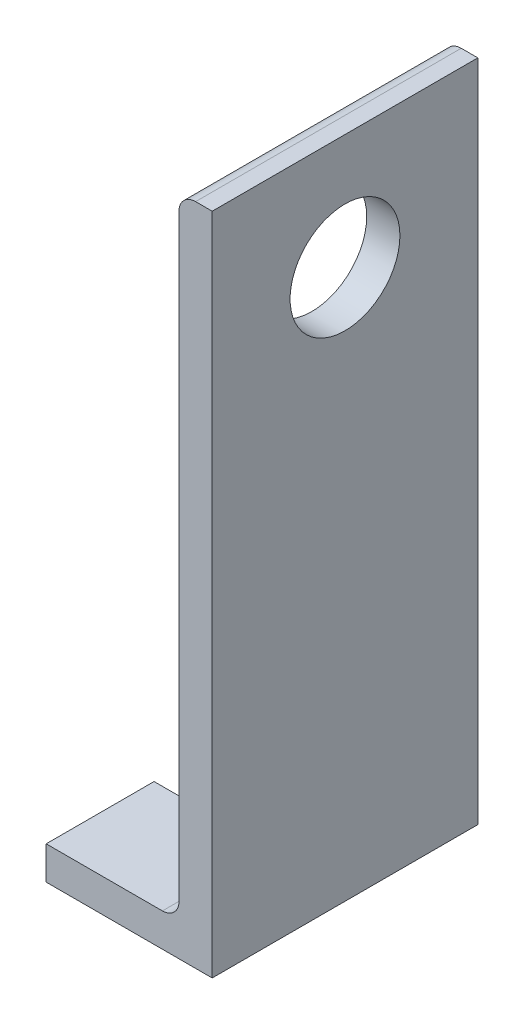
ISO-10303-21;
HEADER;
FILE_DESCRIPTION(('STEP AP214'),'2;1');
FILE_NAME('part.step','',(''),(''),'','','');
FILE_SCHEMA(('AUTOMOTIVE_DESIGN { 1 0 10303 214 1 1 1 1 }'));
ENDSEC;
DATA;
#1=APPLICATION_CONTEXT('core data for automotive mechanical design processes');
#2=APPLICATION_PROTOCOL_DEFINITION('international standard','automotive_design',2000,#1);
#3=PRODUCT_CONTEXT('',#1,'mechanical');
#4=PRODUCT('Part','Part','',(#3));
#5=PRODUCT_RELATED_PRODUCT_CATEGORY('part','',(#4));
#6=PRODUCT_DEFINITION_FORMATION('','',#4);
#7=PRODUCT_DEFINITION_CONTEXT('part definition',#1,'design');
#8=PRODUCT_DEFINITION('design','',#6,#7);
#9=PRODUCT_DEFINITION_SHAPE('','',#8);
#10=(LENGTH_UNIT() NAMED_UNIT(*) SI_UNIT(.MILLI.,.METRE.));
#11=(NAMED_UNIT(*) PLANE_ANGLE_UNIT() SI_UNIT($,.RADIAN.));
#12=(NAMED_UNIT(*) SI_UNIT($,.STERADIAN.) SOLID_ANGLE_UNIT());
#13=UNCERTAINTY_MEASURE_WITH_UNIT(LENGTH_MEASURE(1.E-05),#10,'distance_accuracy_value','');
#14=(GEOMETRIC_REPRESENTATION_CONTEXT(3) GLOBAL_UNCERTAINTY_ASSIGNED_CONTEXT((#13)) GLOBAL_UNIT_ASSIGNED_CONTEXT((#10,
#11,#12)) REPRESENTATION_CONTEXT('',''));
#15=CARTESIAN_POINT('',(0.,0.,0.));
#16=DIRECTION('',(0.,0.,1.));
#17=DIRECTION('',(1.,0.,0.));
#18=AXIS2_PLACEMENT_3D('',#15,#16,#17);
#19=CARTESIAN_POINT('',(-15.875,6.35,25.4));
#20=DIRECTION('',(1.,0.,0.));
#21=DIRECTION('',(0.,0.,-1.));
#22=AXIS2_PLACEMENT_3D('',#19,#20,#21);
#23=PLANE('',#22);
#24=DIRECTION('',(0.,0.,-1.));
#25=VECTOR('',#24,1.);
#26=CARTESIAN_POINT('',(-15.875,0.,25.4));
#27=LINE('',#26,#25);
#28=CARTESIAN_POINT('',(-15.875,0.,-4.765));
#29=VERTEX_POINT('',#28);
#30=CARTESIAN_POINT('',(-15.875,0.,-25.4));
#31=VERTEX_POINT('',#30);
#32=EDGE_CURVE('E237',#29,#31,#27,.T.);
#33=ORIENTED_EDGE('',*,*,#32,.F.);
#34=DIRECTION('',(0.,-1.,0.));
#35=VECTOR('',#34,1.);
#36=CARTESIAN_POINT('',(-15.875,10.,-4.765));
#37=LINE('',#36,#35);
#38=CARTESIAN_POINT('',(-15.875,6.35,-4.765));
#39=VERTEX_POINT('',#38);
#40=EDGE_CURVE('E271',#39,#29,#37,.T.);
#41=ORIENTED_EDGE('',*,*,#40,.F.);
#42=DIRECTION('',(0.,0.,-1.));
#43=VECTOR('',#42,1.);
#44=CARTESIAN_POINT('',(-15.875,6.35,25.4));
#45=LINE('',#44,#43);
#46=CARTESIAN_POINT('',(-15.875,6.35,-25.4));
#47=VERTEX_POINT('',#46);
#48=EDGE_CURVE('E183',#39,#47,#45,.T.);
#49=ORIENTED_EDGE('',*,*,#48,.T.);
#50=DIRECTION('',(0.,-1.,0.));
#51=VECTOR('',#50,1.);
#52=CARTESIAN_POINT('',(-15.875,6.35,-25.4));
#53=LINE('',#52,#51);
#54=EDGE_CURVE('E162',#47,#31,#53,.T.);
#55=ORIENTED_EDGE('',*,*,#54,.T.);
#56=EDGE_LOOP('',(#33,#41,#49,#55));
#57=FACE_BOUND('',#56,.T.);
#58=ADVANCED_FACE('F39',(#57),#23,.F.);
#59=CARTESIAN_POINT('',(-4.826,127.,0.));
#60=DIRECTION('',(0.,-1.,0.));
#61=DIRECTION('',(0.,0.,-1.));
#62=AXIS2_PLACEMENT_3D('',#59,#60,#61);
#63=CYLINDRICAL_SURFACE('',#62,4.765);
#64=DIRECTION('',(0.,-1.,0.));
#65=VECTOR('',#64,1.);
#66=CARTESIAN_POINT('',(-4.826,127.,-4.765));
#67=LINE('',#66,#65);
#68=CARTESIAN_POINT('',(-4.826,0.,-4.765));
#69=VERTEX_POINT('',#68);
#70=CARTESIAN_POINT('',(-4.826,6.34999999999999,-4.765));
#71=VERTEX_POINT('',#70);
#72=EDGE_CURVE('E11',#69,#71,#67,.F.);
#73=ORIENTED_EDGE('',*,*,#72,.F.);
#74=CARTESIAN_POINT('',(-4.826,0.,0.));
#75=DIRECTION('',(0.,-1.,0.));
#76=DIRECTION('',(0.,0.,-1.));
#77=AXIS2_PLACEMENT_3D('',#74,#75,#76);
#78=CIRCLE('',#77,4.765);
#79=CARTESIAN_POINT('',(-4.826,0.,4.765));
#80=VERTEX_POINT('',#79);
#81=EDGE_CURVE('E138',#69,#80,#78,.T.);
#82=ORIENTED_EDGE('',*,*,#81,.T.);
#83=DIRECTION('',(0.,-1.,0.));
#84=VECTOR('',#83,1.);
#85=CARTESIAN_POINT('',(-4.826,127.,4.765));
#86=LINE('',#85,#84);
#87=CARTESIAN_POINT('',(-4.826,6.34999999999999,4.765));
#88=VERTEX_POINT('',#87);
#89=EDGE_CURVE('E48',#80,#88,#86,.F.);
#90=ORIENTED_EDGE('',*,*,#89,.T.);
#91=CARTESIAN_POINT('',(-4.826,6.34999999999999,0.));
#92=DIRECTION('',(0.,-1.,0.));
#93=DIRECTION('',(0.,0.,-1.));
#94=AXIS2_PLACEMENT_3D('',#91,#92,#93);
#95=CIRCLE('',#94,4.765);
#96=EDGE_CURVE('E144',#71,#88,#95,.T.);
#97=ORIENTED_EDGE('',*,*,#96,.F.);
#98=EDGE_LOOP('',(#73,#82,#90,#97));
#99=FACE_BOUND('',#98,.T.);
#100=ADVANCED_FACE('F142',(#99),#63,.F.);
#101=CARTESIAN_POINT('',(-15.875,0.,25.4));
#102=DIRECTION('',(0.,1.,0.));
#103=DIRECTION('',(0.,0.,1.));
#104=AXIS2_PLACEMENT_3D('',#101,#102,#103);
#105=PLANE('',#104);
#106=ORIENTED_EDGE('',*,*,#81,.F.);
#107=DIRECTION('',(1.,0.,0.));
#108=VECTOR('',#107,1.);
#109=CARTESIAN_POINT('',(-4.826,0.,-4.765));
#110=LINE('',#109,#108);
#111=EDGE_CURVE('E62',#29,#69,#110,.T.);
#112=ORIENTED_EDGE('',*,*,#111,.F.);
#113=ORIENTED_EDGE('',*,*,#32,.T.);
#114=DIRECTION('',(1.,0.,0.));
#115=VECTOR('',#114,1.);
#116=CARTESIAN_POINT('',(-15.875,0.,-25.4));
#117=LINE('',#116,#115);
#118=CARTESIAN_POINT('',(15.875,0.,-25.4));
#119=VERTEX_POINT('',#118);
#120=EDGE_CURVE('E149',#31,#119,#117,.T.);
#121=ORIENTED_EDGE('',*,*,#120,.T.);
#122=DIRECTION('',(0.,0.,-1.));
#123=VECTOR('',#122,1.);
#124=CARTESIAN_POINT('',(15.875,0.,25.4));
#125=LINE('',#124,#123);
#126=CARTESIAN_POINT('',(15.875,0.,25.4));
#127=VERTEX_POINT('',#126);
#128=EDGE_CURVE('E233',#127,#119,#125,.T.);
#129=ORIENTED_EDGE('',*,*,#128,.F.);
#130=DIRECTION('',(1.,0.,0.));
#131=VECTOR('',#130,1.);
#132=CARTESIAN_POINT('',(-15.875,0.,25.4));
#133=LINE('',#132,#131);
#134=CARTESIAN_POINT('',(-15.875,0.,25.4));
#135=VERTEX_POINT('',#134);
#136=EDGE_CURVE('E161',#135,#127,#133,.T.);
#137=ORIENTED_EDGE('',*,*,#136,.F.);
#138=CARTESIAN_POINT('',(-15.875,0.,4.765));
#139=VERTEX_POINT('',#138);
#140=EDGE_CURVE('E134',#135,#139,#27,.T.);
#141=ORIENTED_EDGE('',*,*,#140,.T.);
#142=DIRECTION('',(-1.,0.,0.));
#143=VECTOR('',#142,1.);
#144=CARTESIAN_POINT('',(-4.826,0.,4.765));
#145=LINE('',#144,#143);
#146=EDGE_CURVE('E127',#80,#139,#145,.T.);
#147=ORIENTED_EDGE('',*,*,#146,.F.);
#148=EDGE_LOOP('',(#106,#112,#113,#121,#129,#137,#141,#147));
#149=FACE_BOUND('',#148,.T.);
#150=ADVANCED_FACE('F41',(#149),#105,.F.);
#151=CARTESIAN_POINT('',(15.875,0.,25.4));
#152=DIRECTION('',(-1.,0.,0.));
#153=DIRECTION('',(0.,0.,1.));
#154=AXIS2_PLACEMENT_3D('',#151,#152,#153);
#155=PLANE('',#154);
#156=CARTESIAN_POINT('',(15.875,105.,0.));
#157=DIRECTION('',(1.,0.,0.));
#158=DIRECTION('',(0.,0.,-1.));
#159=AXIS2_PLACEMENT_3D('',#156,#157,#158);
#160=CIRCLE('',#159,10.5);
#161=CARTESIAN_POINT('',(15.875,105.,-10.5));
#162=VERTEX_POINT('',#161);
#163=EDGE_CURVE('E152',#162,#162,#160,.T.);
#164=ORIENTED_EDGE('',*,*,#163,.F.);
#165=EDGE_LOOP('',(#164));
#166=FACE_BOUND('',#165,.T.);
#167=DIRECTION('',(0.,1.,0.));
#168=VECTOR('',#167,1.);
#169=CARTESIAN_POINT('',(15.875,0.,-25.4));
#170=LINE('',#169,#168);
#171=CARTESIAN_POINT('',(15.875,127.,-25.4));
#172=VERTEX_POINT('',#171);
#173=EDGE_CURVE('E186',#119,#172,#170,.T.);
#174=ORIENTED_EDGE('',*,*,#173,.T.);
#175=DIRECTION('',(0.,0.,-1.));
#176=VECTOR('',#175,1.);
#177=CARTESIAN_POINT('',(15.875,127.,25.4));
#178=LINE('',#177,#176);
#179=CARTESIAN_POINT('',(15.875,127.,25.4));
#180=VERTEX_POINT('',#179);
#181=EDGE_CURVE('E229',#180,#172,#178,.T.);
#182=ORIENTED_EDGE('',*,*,#181,.F.);
#183=DIRECTION('',(0.,1.,0.));
#184=VECTOR('',#183,1.);
#185=CARTESIAN_POINT('',(15.875,0.,25.4));
#186=LINE('',#185,#184);
#187=EDGE_CURVE('E165',#127,#180,#186,.T.);
#188=ORIENTED_EDGE('',*,*,#187,.F.);
#189=ORIENTED_EDGE('',*,*,#128,.T.);
#190=EDGE_LOOP('',(#174,#182,#188,#189));
#191=FACE_BOUND('',#190,.T.);
#192=ADVANCED_FACE('F254',(#166,#191),#155,.F.);
#193=CARTESIAN_POINT('',(12.7,127.,25.4));
#194=DIRECTION('',(0.,-1.,0.));
#195=DIRECTION('',(0.,0.,-1.));
#196=AXIS2_PLACEMENT_3D('',#193,#194,#195);
#197=PLANE('',#196);
#198=DIRECTION('',(-1.,0.,0.));
#199=VECTOR('',#198,1.);
#200=CARTESIAN_POINT('',(12.7,127.,-25.4));
#201=LINE('',#200,#199);
#202=CARTESIAN_POINT('',(12.7,127.,-25.4));
#203=VERTEX_POINT('',#202);
#204=EDGE_CURVE('E189',#172,#203,#201,.T.);
#205=ORIENTED_EDGE('',*,*,#204,.T.);
#206=DIRECTION('',(0.,0.,-1.));
#207=VECTOR('',#206,1.);
#208=CARTESIAN_POINT('',(12.7,127.,25.4));
#209=LINE('',#208,#207);
#210=CARTESIAN_POINT('',(12.7,127.,25.4));
#211=VERTEX_POINT('',#210);
#212=EDGE_CURVE('E225',#211,#203,#209,.T.);
#213=ORIENTED_EDGE('',*,*,#212,.F.);
#214=DIRECTION('',(-1.,0.,0.));
#215=VECTOR('',#214,1.);
#216=CARTESIAN_POINT('',(12.7,127.,25.4));
#217=LINE('',#216,#215);
#218=EDGE_CURVE('E168',#180,#211,#217,.T.);
#219=ORIENTED_EDGE('',*,*,#218,.F.);
#220=ORIENTED_EDGE('',*,*,#181,.T.);
#221=EDGE_LOOP('',(#205,#213,#219,#220));
#222=FACE_BOUND('',#221,.T.);
#223=ADVANCED_FACE('F258',(#222),#197,.F.);
#224=CARTESIAN_POINT('',(12.7,123.825,25.4));
#225=DIRECTION('',(0.,0.,-1.));
#226=DIRECTION('',(-1.,0.,0.));
#227=AXIS2_PLACEMENT_3D('',#224,#225,#226);
#228=CYLINDRICAL_SURFACE('',#227,3.175);
#229=CARTESIAN_POINT('',(12.7,123.825,-25.4));
#230=DIRECTION('',(0.,0.,1.));
#231=DIRECTION('',(-1.,0.,0.));
#232=AXIS2_PLACEMENT_3D('',#229,#230,#231);
#233=CIRCLE('',#232,3.175);
#234=CARTESIAN_POINT('',(9.525,123.825,-25.4));
#235=VERTEX_POINT('',#234);
#236=EDGE_CURVE('E192',#203,#235,#233,.T.);
#237=ORIENTED_EDGE('',*,*,#236,.T.);
#238=DIRECTION('',(0.,0.,-1.));
#239=VECTOR('',#238,1.);
#240=CARTESIAN_POINT('',(9.525,123.825,25.4));
#241=LINE('',#240,#239);
#242=CARTESIAN_POINT('',(9.525,123.825,25.4));
#243=VERTEX_POINT('',#242);
#244=EDGE_CURVE('E221',#243,#235,#241,.T.);
#245=ORIENTED_EDGE('',*,*,#244,.F.);
#246=CARTESIAN_POINT('',(12.7,123.825,25.4));
#247=DIRECTION('',(0.,0.,1.));
#248=DIRECTION('',(-1.,0.,0.));
#249=AXIS2_PLACEMENT_3D('',#246,#247,#248);
#250=CIRCLE('',#249,3.175);
#251=EDGE_CURVE('E171',#211,#243,#250,.T.);
#252=ORIENTED_EDGE('',*,*,#251,.F.);
#253=ORIENTED_EDGE('',*,*,#212,.T.);
#254=EDGE_LOOP('',(#237,#245,#252,#253));
#255=FACE_BOUND('',#254,.T.);
#256=ADVANCED_FACE('F295',(#255),#228,.T.);
#257=CARTESIAN_POINT('',(9.525,123.825,25.4));
#258=DIRECTION('',(1.,0.,0.));
#259=DIRECTION('',(0.,1.,0.));
#260=AXIS2_PLACEMENT_3D('',#257,#258,#259);
#261=PLANE('',#260);
#262=CARTESIAN_POINT('',(9.52500000000001,105.,0.));
#263=DIRECTION('',(1.,0.,0.));
#264=DIRECTION('',(0.,1.,0.));
#265=AXIS2_PLACEMENT_3D('',#262,#263,#264);
#266=CIRCLE('',#265,10.5);
#267=CARTESIAN_POINT('',(9.525,115.5,0.));
#268=VERTEX_POINT('',#267);
#269=EDGE_CURVE('E145',#268,#268,#266,.T.);
#270=ORIENTED_EDGE('',*,*,#269,.T.);
#271=EDGE_LOOP('',(#270));
#272=FACE_BOUND('',#271,.T.);
#273=DIRECTION('',(0.,-1.,0.));
#274=VECTOR('',#273,1.);
#275=CARTESIAN_POINT('',(9.525,123.825,-25.4));
#276=LINE('',#275,#274);
#277=CARTESIAN_POINT('',(9.52500000000003,9.52500000000001,-25.4));
#278=VERTEX_POINT('',#277);
#279=EDGE_CURVE('E195',#235,#278,#276,.T.);
#280=ORIENTED_EDGE('',*,*,#279,.T.);
#281=DIRECTION('',(0.,0.,-1.));
#282=VECTOR('',#281,1.);
#283=CARTESIAN_POINT('',(9.52500000000003,9.52500000000001,25.4));
#284=LINE('',#283,#282);
#285=CARTESIAN_POINT('',(9.52500000000003,9.52500000000001,25.4));
#286=VERTEX_POINT('',#285);
#287=EDGE_CURVE('E217',#286,#278,#284,.T.);
#288=ORIENTED_EDGE('',*,*,#287,.F.);
#289=DIRECTION('',(0.,-1.,0.));
#290=VECTOR('',#289,1.);
#291=CARTESIAN_POINT('',(9.525,123.825,25.4));
#292=LINE('',#291,#290);
#293=EDGE_CURVE('E174',#243,#286,#292,.T.);
#294=ORIENTED_EDGE('',*,*,#293,.F.);
#295=ORIENTED_EDGE('',*,*,#244,.T.);
#296=EDGE_LOOP('',(#280,#288,#294,#295));
#297=FACE_BOUND('',#296,.T.);
#298=ADVANCED_FACE('F316',(#272,#297),#261,.F.);
#299=CARTESIAN_POINT('',(6.35000000000003,9.52500000000001,25.4));
#300=DIRECTION('',(0.,0.,-1.));
#301=DIRECTION('',(-1.,0.,0.));
#302=AXIS2_PLACEMENT_3D('',#299,#300,#301);
#303=CYLINDRICAL_SURFACE('',#302,3.175);
#304=CARTESIAN_POINT('',(6.35000000000003,9.52500000000001,-25.4));
#305=DIRECTION('',(0.,0.,-1.));
#306=DIRECTION('',(-1.,0.,0.));
#307=AXIS2_PLACEMENT_3D('',#304,#305,#306);
#308=CIRCLE('',#307,3.175);
#309=CARTESIAN_POINT('',(6.35000000000003,6.35,-25.4));
#310=VERTEX_POINT('',#309);
#311=EDGE_CURVE('E198',#278,#310,#308,.T.);
#312=ORIENTED_EDGE('',*,*,#311,.T.);
#313=DIRECTION('',(0.,0.,-1.));
#314=VECTOR('',#313,1.);
#315=CARTESIAN_POINT('',(6.35000000000003,6.35,25.4));
#316=LINE('',#315,#314);
#317=CARTESIAN_POINT('',(6.35000000000003,6.35,25.4));
#318=VERTEX_POINT('',#317);
#319=EDGE_CURVE('E213',#318,#310,#316,.T.);
#320=ORIENTED_EDGE('',*,*,#319,.F.);
#321=CARTESIAN_POINT('',(6.35000000000003,9.52500000000001,25.4));
#322=DIRECTION('',(0.,0.,-1.));
#323=DIRECTION('',(-1.,0.,0.));
#324=AXIS2_PLACEMENT_3D('',#321,#322,#323);
#325=CIRCLE('',#324,3.175);
#326=EDGE_CURVE('E177',#286,#318,#325,.T.);
#327=ORIENTED_EDGE('',*,*,#326,.F.);
#328=ORIENTED_EDGE('',*,*,#287,.T.);
#329=EDGE_LOOP('',(#312,#320,#327,#328));
#330=FACE_BOUND('',#329,.T.);
#331=ADVANCED_FACE('F312',(#330),#303,.F.);
#332=CARTESIAN_POINT('',(-12.7,6.35,25.4));
#333=DIRECTION('',(0.,-1.,0.));
#334=DIRECTION('',(0.,0.,-1.));
#335=AXIS2_PLACEMENT_3D('',#332,#333,#334);
#336=PLANE('',#335);
#337=ORIENTED_EDGE('',*,*,#48,.F.);
#338=DIRECTION('',(1.,0.,0.));
#339=VECTOR('',#338,1.);
#340=CARTESIAN_POINT('',(-12.7,6.35,-4.765));
#341=LINE('',#340,#339);
#342=EDGE_CURVE('E279',#39,#71,#341,.T.);
#343=ORIENTED_EDGE('',*,*,#342,.T.);
#344=ORIENTED_EDGE('',*,*,#96,.T.);
#345=DIRECTION('',(-1.,0.,0.));
#346=VECTOR('',#345,1.);
#347=CARTESIAN_POINT('',(-12.7,6.35,4.765));
#348=LINE('',#347,#346);
#349=CARTESIAN_POINT('',(-15.875,6.35,4.765));
#350=VERTEX_POINT('',#349);
#351=EDGE_CURVE('E55',#88,#350,#348,.T.);
#352=ORIENTED_EDGE('',*,*,#351,.T.);
#353=CARTESIAN_POINT('',(-15.875,6.35,25.4));
#354=VERTEX_POINT('',#353);
#355=EDGE_CURVE('E209',#354,#350,#45,.T.);
#356=ORIENTED_EDGE('',*,*,#355,.F.);
#357=DIRECTION('',(-1.,0.,0.));
#358=VECTOR('',#357,1.);
#359=CARTESIAN_POINT('',(6.35000000000003,6.35,25.4));
#360=LINE('',#359,#358);
#361=EDGE_CURVE('E180',#318,#354,#360,.T.);
#362=ORIENTED_EDGE('',*,*,#361,.F.);
#363=ORIENTED_EDGE('',*,*,#319,.T.);
#364=DIRECTION('',(-1.,0.,0.));
#365=VECTOR('',#364,1.);
#366=CARTESIAN_POINT('',(-12.7,6.35,-25.4));
#367=LINE('',#366,#365);
#368=EDGE_CURVE('E202',#310,#47,#367,.T.);
#369=ORIENTED_EDGE('',*,*,#368,.T.);
#370=EDGE_LOOP('',(#337,#343,#344,#352,#356,#362,#363,#369));
#371=FACE_BOUND('',#370,.T.);
#372=ADVANCED_FACE('F306',(#371),#336,.F.);
#373=ORIENTED_EDGE('',*,*,#355,.T.);
#374=DIRECTION('',(0.,-1.,0.));
#375=VECTOR('',#374,1.);
#376=CARTESIAN_POINT('',(-15.875,10.,4.765));
#377=LINE('',#376,#375);
#378=EDGE_CURVE('E269',#350,#139,#377,.T.);
#379=ORIENTED_EDGE('',*,*,#378,.T.);
#380=ORIENTED_EDGE('',*,*,#140,.F.);
#381=DIRECTION('',(0.,-1.,0.));
#382=VECTOR('',#381,1.);
#383=CARTESIAN_POINT('',(-15.875,3.175,25.4));
#384=LINE('',#383,#382);
#385=EDGE_CURVE('E157',#354,#135,#384,.T.);
#386=ORIENTED_EDGE('',*,*,#385,.F.);
#387=EDGE_LOOP('',(#373,#379,#380,#386));
#388=FACE_BOUND('',#387,.T.);
#389=ADVANCED_FACE('F268',(#388),#23,.F.);
#390=CARTESIAN_POINT('',(12.7,123.825,25.4));
#391=DIRECTION('',(0.,0.,-1.));
#392=DIRECTION('',(-1.,0.,0.));
#393=AXIS2_PLACEMENT_3D('',#390,#391,#392);
#394=PLANE('',#393);
#395=ORIENTED_EDGE('',*,*,#385,.T.);
#396=ORIENTED_EDGE('',*,*,#136,.T.);
#397=ORIENTED_EDGE('',*,*,#187,.T.);
#398=ORIENTED_EDGE('',*,*,#218,.T.);
#399=ORIENTED_EDGE('',*,*,#251,.T.);
#400=ORIENTED_EDGE('',*,*,#293,.T.);
#401=ORIENTED_EDGE('',*,*,#326,.T.);
#402=ORIENTED_EDGE('',*,*,#361,.T.);
#403=EDGE_LOOP('',(#395,#396,#397,#398,#399,#400,#401,#402));
#404=FACE_BOUND('',#403,.T.);
#405=ADVANCED_FACE('F262',(#404),#394,.F.);
#406=CARTESIAN_POINT('',(12.7,123.825,-25.4));
#407=DIRECTION('',(0.,0.,-1.));
#408=DIRECTION('',(-1.,0.,0.));
#409=AXIS2_PLACEMENT_3D('',#406,#407,#408);
#410=PLANE('',#409);
#411=ORIENTED_EDGE('',*,*,#120,.F.);
#412=ORIENTED_EDGE('',*,*,#54,.F.);
#413=ORIENTED_EDGE('',*,*,#368,.F.);
#414=ORIENTED_EDGE('',*,*,#311,.F.);
#415=ORIENTED_EDGE('',*,*,#279,.F.);
#416=ORIENTED_EDGE('',*,*,#236,.F.);
#417=ORIENTED_EDGE('',*,*,#204,.F.);
#418=ORIENTED_EDGE('',*,*,#173,.F.);
#419=EDGE_LOOP('',(#411,#412,#413,#414,#415,#416,#417,#418));
#420=FACE_BOUND('',#419,.T.);
#421=ADVANCED_FACE('F249',(#420),#410,.T.);
#422=CARTESIAN_POINT('',(5.875,105.,0.));
#423=DIRECTION('',(1.,0.,0.));
#424=DIRECTION('',(0.,0.,-1.));
#425=AXIS2_PLACEMENT_3D('',#422,#423,#424);
#426=CYLINDRICAL_SURFACE('',#425,10.5);
#427=ORIENTED_EDGE('',*,*,#163,.T.);
#428=EDGE_LOOP('',(#427));
#429=FACE_BOUND('',#428,.T.);
#430=ORIENTED_EDGE('',*,*,#269,.F.);
#431=EDGE_LOOP('',(#430));
#432=FACE_BOUND('',#431,.T.);
#433=ADVANCED_FACE('F287',(#429,#432),#426,.F.);
#434=CARTESIAN_POINT('',(-4.826,10.,4.765));
#435=DIRECTION('',(0.,0.,1.));
#436=DIRECTION('',(1.,0.,0.));
#437=AXIS2_PLACEMENT_3D('',#434,#435,#436);
#438=PLANE('',#437);
#439=ORIENTED_EDGE('',*,*,#89,.F.);
#440=ORIENTED_EDGE('',*,*,#146,.T.);
#441=ORIENTED_EDGE('',*,*,#378,.F.);
#442=ORIENTED_EDGE('',*,*,#351,.F.);
#443=EDGE_LOOP('',(#439,#440,#441,#442));
#444=FACE_BOUND('',#443,.T.);
#445=ADVANCED_FACE('F126',(#444),#438,.F.);
#446=CARTESIAN_POINT('',(-4.826,10.,-4.765));
#447=DIRECTION('',(0.,0.,-1.));
#448=DIRECTION('',(-1.,0.,0.));
#449=AXIS2_PLACEMENT_3D('',#446,#447,#448);
#450=PLANE('',#449);
#451=ORIENTED_EDGE('',*,*,#40,.T.);
#452=ORIENTED_EDGE('',*,*,#111,.T.);
#453=ORIENTED_EDGE('',*,*,#72,.T.);
#454=ORIENTED_EDGE('',*,*,#342,.F.);
#455=EDGE_LOOP('',(#451,#452,#453,#454));
#456=FACE_BOUND('',#455,.T.);
#457=ADVANCED_FACE('F401',(#456),#450,.F.);
#458=CLOSED_SHELL('',(#58,#100,#150,#192,#223,#256,#298,#331,#372,#389,#405,#421,#433,#445,#457));
#459=MANIFOLD_SOLID_BREP('B2',#458);
#460=ADVANCED_BREP_SHAPE_REPRESENTATION('',(#18,#459),#14);
#461=SHAPE_DEFINITION_REPRESENTATION(#9,#460);
ENDSEC;
END-ISO-10303-21;
